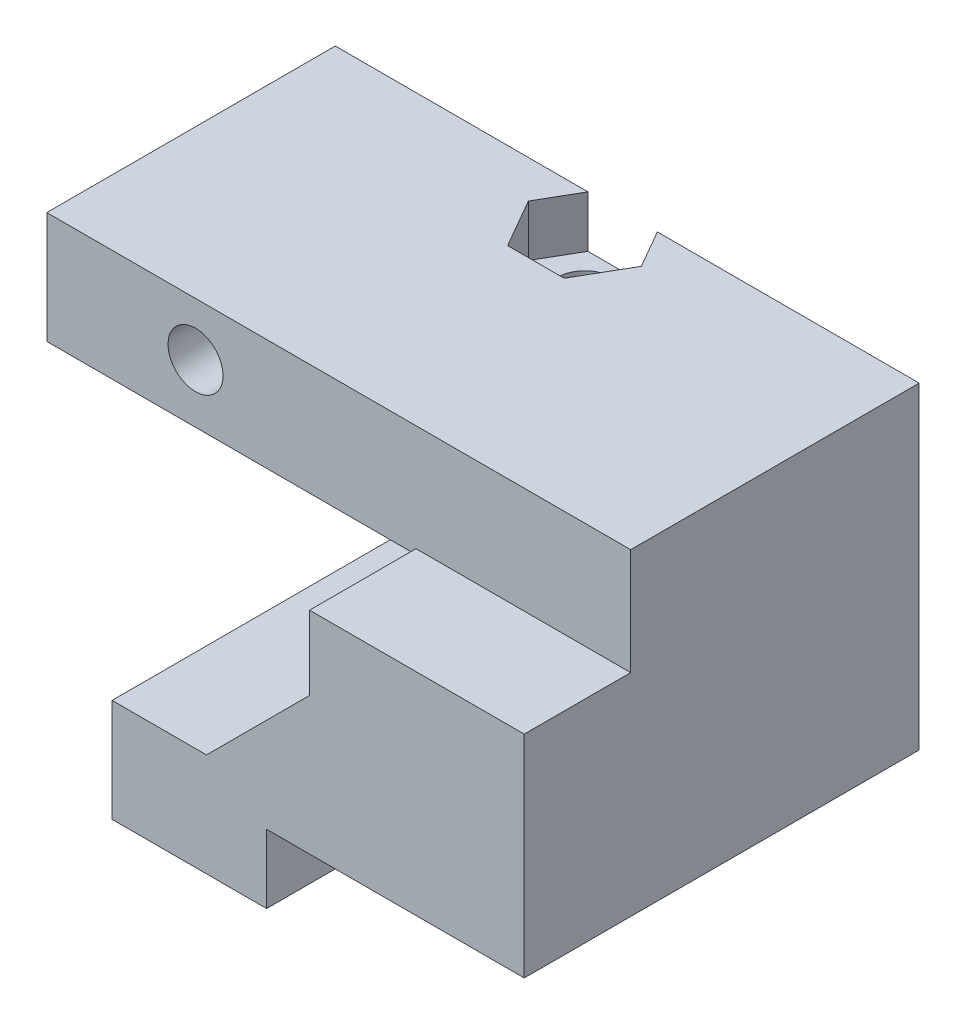
ISO-10303-21;
HEADER;
FILE_DESCRIPTION(('STEP AP214'),'2;1');
FILE_NAME('part.step','',(''),(''),'','','');
FILE_SCHEMA(('AUTOMOTIVE_DESIGN { 1 0 10303 214 1 1 1 1 }'));
ENDSEC;
DATA;
#1=APPLICATION_CONTEXT('core data for automotive mechanical design processes');
#2=APPLICATION_PROTOCOL_DEFINITION('international standard','automotive_design',2000,#1);
#3=PRODUCT_CONTEXT('',#1,'mechanical');
#4=PRODUCT('Part','Part','',(#3));
#5=PRODUCT_RELATED_PRODUCT_CATEGORY('part','',(#4));
#6=PRODUCT_DEFINITION_FORMATION('','',#4);
#7=PRODUCT_DEFINITION_CONTEXT('part definition',#1,'design');
#8=PRODUCT_DEFINITION('design','',#6,#7);
#9=PRODUCT_DEFINITION_SHAPE('','',#8);
#10=(LENGTH_UNIT() NAMED_UNIT(*) SI_UNIT(.MILLI.,.METRE.));
#11=(NAMED_UNIT(*) PLANE_ANGLE_UNIT() SI_UNIT($,.RADIAN.));
#12=(NAMED_UNIT(*) SI_UNIT($,.STERADIAN.) SOLID_ANGLE_UNIT());
#13=UNCERTAINTY_MEASURE_WITH_UNIT(LENGTH_MEASURE(1.E-05),#10,'distance_accuracy_value','');
#14=(GEOMETRIC_REPRESENTATION_CONTEXT(3) GLOBAL_UNCERTAINTY_ASSIGNED_CONTEXT((#13)) GLOBAL_UNIT_ASSIGNED_CONTEXT((#10,
#11,#12)) REPRESENTATION_CONTEXT('',''));
#15=CARTESIAN_POINT('',(0.,0.,0.));
#16=DIRECTION('',(0.,0.,1.));
#17=DIRECTION('',(1.,0.,0.));
#18=AXIS2_PLACEMENT_3D('',#15,#16,#17);
#19=CARTESIAN_POINT('',(6.73,22.501,2.2));
#20=DIRECTION('',(0.,-1.,0.));
#21=DIRECTION('',(0.,0.,-1.));
#22=AXIS2_PLACEMENT_3D('',#19,#20,#21);
#23=CYLINDRICAL_SURFACE('',#22,1.6);
#24=CARTESIAN_POINT('',(6.73,16.,2.2));
#25=DIRECTION('',(0.,-1.,0.));
#26=DIRECTION('',(0.,0.,-1.));
#27=AXIS2_PLACEMENT_3D('',#24,#25,#26);
#28=CIRCLE('',#27,1.6);
#29=CARTESIAN_POINT('',(6.73,16.,0.599999999999997));
#30=VERTEX_POINT('',#29);
#31=EDGE_CURVE('E499',#30,#30,#28,.T.);
#32=ORIENTED_EDGE('',*,*,#31,.T.);
#33=EDGE_LOOP('',(#32));
#34=FACE_BOUND('',#33,.T.);
#35=CARTESIAN_POINT('',(6.73,19.5,2.2));
#36=DIRECTION('',(0.,1.,0.));
#37=DIRECTION('',(0.,0.,1.));
#38=AXIS2_PLACEMENT_3D('',#35,#36,#37);
#39=CIRCLE('',#38,1.6);
#40=CARTESIAN_POINT('',(6.73,19.5,3.8));
#41=VERTEX_POINT('',#40);
#42=EDGE_CURVE('E287',#41,#41,#39,.F.);
#43=ORIENTED_EDGE('',*,*,#42,.F.);
#44=EDGE_LOOP('',(#43));
#45=FACE_BOUND('',#44,.T.);
#46=ADVANCED_FACE('F35',(#34,#45),#23,.F.);
#47=CARTESIAN_POINT('',(11.5,6.,23.));
#48=DIRECTION('',(0.,-1.,0.));
#49=DIRECTION('',(1.,0.,0.));
#50=AXIS2_PLACEMENT_3D('',#47,#48,#49);
#51=PLANE('',#50);
#52=DIRECTION('',(-1.,0.,0.));
#53=VECTOR('',#52,1.);
#54=CARTESIAN_POINT('',(6.59544826719043,6.,0.449999999999999));
#55=LINE('',#54,#53);
#56=CARTESIAN_POINT('',(5.5,6.,0.45));
#57=VERTEX_POINT('',#56);
#58=CARTESIAN_POINT('',(3.30455173280957,6.,0.45));
#59=VERTEX_POINT('',#58);
#60=EDGE_CURVE('E297',#57,#59,#55,.T.);
#61=ORIENTED_EDGE('',*,*,#60,.F.);
#62=DIRECTION('',(0.,0.,-1.));
#63=VECTOR('',#62,1.);
#64=CARTESIAN_POINT('',(5.5,6.,31.4852813742386));
#65=LINE('',#64,#63);
#66=CARTESIAN_POINT('',(5.5,6.,0.));
#67=VERTEX_POINT('',#66);
#68=EDGE_CURVE('E352',#57,#67,#65,.T.);
#69=ORIENTED_EDGE('',*,*,#68,.T.);
#70=DIRECTION('',(-1.,0.,0.));
#71=VECTOR('',#70,1.);
#72=CARTESIAN_POINT('',(11.5,6.,0.));
#73=LINE('',#72,#71);
#74=CARTESIAN_POINT('',(0.,6.,0.));
#75=VERTEX_POINT('',#74);
#76=EDGE_CURVE('E398',#67,#75,#73,.T.);
#77=ORIENTED_EDGE('',*,*,#76,.T.);
#78=DIRECTION('',(0.,0.,-1.));
#79=VECTOR('',#78,1.);
#80=CARTESIAN_POINT('',(0.,6.,23.));
#81=LINE('',#80,#79);
#82=CARTESIAN_POINT('',(0.,6.,23.));
#83=VERTEX_POINT('',#82);
#84=EDGE_CURVE('E394',#83,#75,#81,.T.);
#85=ORIENTED_EDGE('',*,*,#84,.F.);
#86=DIRECTION('',(-1.,0.,0.));
#87=VECTOR('',#86,1.);
#88=CARTESIAN_POINT('',(11.5,6.,23.));
#89=LINE('',#88,#87);
#90=CARTESIAN_POINT('',(5.5,6.,23.));
#91=VERTEX_POINT('',#90);
#92=EDGE_CURVE('E397',#91,#83,#89,.T.);
#93=ORIENTED_EDGE('',*,*,#92,.F.);
#94=CARTESIAN_POINT('',(5.5,6.,6.15));
#95=VERTEX_POINT('',#94);
#96=EDGE_CURVE('E356',#91,#95,#65,.T.);
#97=ORIENTED_EDGE('',*,*,#96,.T.);
#98=DIRECTION('',(1.,0.,0.));
#99=VECTOR('',#98,1.);
#100=CARTESIAN_POINT('',(3.30455173280957,6.,6.15));
#101=LINE('',#100,#99);
#102=CARTESIAN_POINT('',(3.30455173280957,6.,6.15));
#103=VERTEX_POINT('',#102);
#104=EDGE_CURVE('E58',#103,#95,#101,.T.);
#105=ORIENTED_EDGE('',*,*,#104,.F.);
#106=DIRECTION('',(0.5,0.,0.866025403784438));
#107=VECTOR('',#106,1.);
#108=CARTESIAN_POINT('',(1.65910346561913,6.,3.3));
#109=LINE('',#108,#107);
#110=CARTESIAN_POINT('',(1.65910346561913,6.,3.3));
#111=VERTEX_POINT('',#110);
#112=EDGE_CURVE('E315',#111,#103,#109,.T.);
#113=ORIENTED_EDGE('',*,*,#112,.F.);
#114=DIRECTION('',(-0.5,0.,0.866025403784439));
#115=VECTOR('',#114,1.);
#116=CARTESIAN_POINT('',(3.30455173280957,6.,0.45));
#117=LINE('',#116,#115);
#118=EDGE_CURVE('E292',#59,#111,#117,.T.);
#119=ORIENTED_EDGE('',*,*,#118,.F.);
#120=EDGE_LOOP('',(#61,#69,#77,#85,#93,#97,#105,#113,#119));
#121=FACE_BOUND('',#120,.T.);
#122=ADVANCED_FACE('F560',(#121),#51,.F.);
#123=CARTESIAN_POINT('',(4.95,22.501,3.3));
#124=DIRECTION('',(0.,-1.,0.));
#125=DIRECTION('',(0.,0.,-1.));
#126=AXIS2_PLACEMENT_3D('',#123,#124,#125);
#127=CYLINDRICAL_SURFACE('',#126,1.6);
#128=CARTESIAN_POINT('',(4.95,0.,3.3));
#129=DIRECTION('',(0.,-1.,0.));
#130=DIRECTION('',(0.,0.,-1.));
#131=AXIS2_PLACEMENT_3D('',#128,#129,#130);
#132=CIRCLE('',#131,1.6);
#133=CARTESIAN_POINT('',(4.95,0.,1.7));
#134=VERTEX_POINT('',#133);
#135=EDGE_CURVE('E358',#134,#134,#132,.T.);
#136=ORIENTED_EDGE('',*,*,#135,.T.);
#137=EDGE_LOOP('',(#136));
#138=FACE_BOUND('',#137,.T.);
#139=CARTESIAN_POINT('',(4.95,2.,3.3));
#140=DIRECTION('',(0.,1.,0.));
#141=DIRECTION('',(-1.,0.,0.));
#142=AXIS2_PLACEMENT_3D('',#139,#140,#141);
#143=CIRCLE('',#142,1.6);
#144=CARTESIAN_POINT('',(3.35,2.,3.3));
#145=VERTEX_POINT('',#144);
#146=EDGE_CURVE('E341',#145,#145,#143,.F.);
#147=ORIENTED_EDGE('',*,*,#146,.F.);
#148=EDGE_LOOP('',(#147));
#149=FACE_BOUND('',#148,.T.);
#150=ADVANCED_FACE('F517',(#138,#149),#127,.F.);
#151=CARTESIAN_POINT('',(5.5,6.,31.4852813742386));
#152=DIRECTION('',(-0.707106781186551,0.707106781186544,0.));
#153=DIRECTION('',(-0.707106781186544,-0.707106781186551,0.));
#154=AXIS2_PLACEMENT_3D('',#151,#152,#153);
#155=PLANE('',#154);
#156=ORIENTED_EDGE('',*,*,#68,.F.);
#157=DIRECTION('',(-0.707106781186544,-0.707106781186551,0.));
#158=VECTOR('',#157,1.);
#159=CARTESIAN_POINT('',(14.2982241335952,14.7982241335953,0.449999999999997));
#160=LINE('',#159,#158);
#161=CARTESIAN_POINT('',(6.59544826719044,7.09544826719045,0.449999999999999));
#162=VERTEX_POINT('',#161);
#163=EDGE_CURVE('E331',#162,#57,#160,.T.);
#164=ORIENTED_EDGE('',*,*,#163,.F.);
#165=DIRECTION('',(-0.447213595499957,-0.447213595499961,-0.774596669241482));
#166=VECTOR('',#165,1.);
#167=CARTESIAN_POINT('',(10.9929172275047,11.4929172275048,8.0666396639714));
#168=LINE('',#167,#166);
#169=CARTESIAN_POINT('',(8.24089653438087,8.7408965343809,3.3));
#170=VERTEX_POINT('',#169);
#171=EDGE_CURVE('E327',#170,#162,#168,.T.);
#172=ORIENTED_EDGE('',*,*,#171,.F.);
#173=DIRECTION('',(0.447213595499957,0.447213595499961,-0.774596669241482));
#174=VECTOR('',#173,1.);
#175=CARTESIAN_POINT('',(9.67655861375236,10.1765586137524,0.813360336028591));
#176=LINE('',#175,#174);
#177=CARTESIAN_POINT('',(6.59544826719044,7.09544826719045,6.15));
#178=VERTEX_POINT('',#177);
#179=EDGE_CURVE('E330',#178,#170,#176,.T.);
#180=ORIENTED_EDGE('',*,*,#179,.F.);
#181=DIRECTION('',(0.707106781186544,0.707106781186551,0.));
#182=VECTOR('',#181,1.);
#183=CARTESIAN_POINT('',(12.6527758664048,13.1527758664049,6.15));
#184=LINE('',#183,#182);
#185=EDGE_CURVE('E334',#95,#178,#184,.T.);
#186=ORIENTED_EDGE('',*,*,#185,.F.);
#187=ORIENTED_EDGE('',*,*,#96,.F.);
#188=DIRECTION('',(0.707106781186544,0.707106781186551,0.));
#189=VECTOR('',#188,1.);
#190=CARTESIAN_POINT('',(5.5,6.,23.));
#191=LINE('',#190,#189);
#192=CARTESIAN_POINT('',(11.5,12.0000000000001,23.));
#193=VERTEX_POINT('',#192);
#194=EDGE_CURVE('E353',#91,#193,#191,.T.);
#195=ORIENTED_EDGE('',*,*,#194,.T.);
#196=DIRECTION('',(0.,0.,-1.));
#197=VECTOR('',#196,1.);
#198=CARTESIAN_POINT('',(11.5,12.0000000000001,31.4852813742386));
#199=LINE('',#198,#197);
#200=CARTESIAN_POINT('',(11.5,12.0000000000001,0.));
#201=VERTEX_POINT('',#200);
#202=EDGE_CURVE('E355',#193,#201,#199,.T.);
#203=ORIENTED_EDGE('',*,*,#202,.T.);
#204=DIRECTION('',(0.707106781186544,0.707106781186551,0.));
#205=VECTOR('',#204,1.);
#206=CARTESIAN_POINT('',(5.5,6.,0.));
#207=LINE('',#206,#205);
#208=EDGE_CURVE('E349',#67,#201,#207,.T.);
#209=ORIENTED_EDGE('',*,*,#208,.F.);
#210=EDGE_LOOP('',(#156,#164,#172,#180,#186,#187,#195,#203,#209));
#211=FACE_BOUND('',#210,.T.);
#212=ADVANCED_FACE('F565',(#211),#155,.T.);
#213=CARTESIAN_POINT('',(-10.,22.5,23.));
#214=DIRECTION('',(1.,0.,0.));
#215=DIRECTION('',(0.,0.,-1.));
#216=AXIS2_PLACEMENT_3D('',#213,#214,#215);
#217=PLANE('',#216);
#218=DIRECTION('',(0.,0.,-1.));
#219=VECTOR('',#218,1.);
#220=CARTESIAN_POINT('',(-10.,16.,23.));
#221=LINE('',#220,#219);
#222=CARTESIAN_POINT('',(-10.,16.,16.8));
#223=VERTEX_POINT('',#222);
#224=CARTESIAN_POINT('',(-10.,16.,0.));
#225=VERTEX_POINT('',#224);
#226=EDGE_CURVE('E390',#223,#225,#221,.T.);
#227=ORIENTED_EDGE('',*,*,#226,.F.);
#228=DIRECTION('',(0.,-1.,0.));
#229=VECTOR('',#228,1.);
#230=CARTESIAN_POINT('',(-10.,22.5,16.8));
#231=LINE('',#230,#229);
#232=CARTESIAN_POINT('',(-10.,22.5,16.8));
#233=VERTEX_POINT('',#232);
#234=EDGE_CURVE('E447',#233,#223,#231,.T.);
#235=ORIENTED_EDGE('',*,*,#234,.F.);
#236=DIRECTION('',(0.,0.,-1.));
#237=VECTOR('',#236,1.);
#238=CARTESIAN_POINT('',(-10.,22.5,23.));
#239=LINE('',#238,#237);
#240=CARTESIAN_POINT('',(-10.,22.5,0.));
#241=VERTEX_POINT('',#240);
#242=EDGE_CURVE('E387',#233,#241,#239,.T.);
#243=ORIENTED_EDGE('',*,*,#242,.T.);
#244=DIRECTION('',(0.,-1.,0.));
#245=VECTOR('',#244,1.);
#246=CARTESIAN_POINT('',(-10.,22.5,0.));
#247=LINE('',#246,#245);
#248=EDGE_CURVE('E407',#241,#225,#247,.T.);
#249=ORIENTED_EDGE('',*,*,#248,.T.);
#250=EDGE_LOOP('',(#227,#235,#243,#249));
#251=FACE_BOUND('',#250,.T.);
#252=ADVANCED_FACE('F663',(#251),#217,.F.);
#253=CARTESIAN_POINT('',(-10.,16.,23.));
#254=DIRECTION('',(0.,1.,0.));
#255=DIRECTION('',(-1.,0.,0.));
#256=AXIS2_PLACEMENT_3D('',#253,#254,#255);
#257=PLANE('',#256);
#258=ORIENTED_EDGE('',*,*,#31,.F.);
#259=EDGE_LOOP('',(#258));
#260=FACE_BOUND('',#259,.T.);
#261=DIRECTION('',(-1.,0.,0.));
#262=VECTOR('',#261,1.);
#263=CARTESIAN_POINT('',(11.5,16.,16.8));
#264=LINE('',#263,#262);
#265=CARTESIAN_POINT('',(11.5,16.,16.8));
#266=VERTEX_POINT('',#265);
#267=EDGE_CURVE('E458',#266,#223,#264,.T.);
#268=ORIENTED_EDGE('',*,*,#267,.T.);
#269=ORIENTED_EDGE('',*,*,#226,.T.);
#270=DIRECTION('',(1.,0.,0.));
#271=VECTOR('',#270,1.);
#272=CARTESIAN_POINT('',(-10.,16.,0.));
#273=LINE('',#272,#271);
#274=CARTESIAN_POINT('',(11.5,16.,0.));
#275=VERTEX_POINT('',#274);
#276=EDGE_CURVE('E404',#225,#275,#273,.T.);
#277=ORIENTED_EDGE('',*,*,#276,.T.);
#278=DIRECTION('',(0.,0.,-1.));
#279=VECTOR('',#278,1.);
#280=CARTESIAN_POINT('',(11.5,16.,23.));
#281=LINE('',#280,#279);
#282=EDGE_CURVE('E392',#266,#275,#281,.T.);
#283=ORIENTED_EDGE('',*,*,#282,.F.);
#284=EDGE_LOOP('',(#268,#269,#277,#283));
#285=FACE_BOUND('',#284,.T.);
#286=ADVANCED_FACE('F659',(#260,#285),#257,.F.);
#287=CARTESIAN_POINT('',(24.,22.5,23.));
#288=DIRECTION('',(0.,-1.,0.));
#289=DIRECTION('',(1.,0.,0.));
#290=AXIS2_PLACEMENT_3D('',#287,#288,#289);
#291=PLANE('',#290);
#292=DIRECTION('',(0.5,0.,0.866025403784438));
#293=VECTOR('',#292,1.);
#294=CARTESIAN_POINT('',(3.43910346561913,22.5,2.2));
#295=LINE('',#294,#293);
#296=CARTESIAN_POINT('',(3.43910346561913,22.5,2.2));
#297=VERTEX_POINT('',#296);
#298=CARTESIAN_POINT('',(5.08455173280957,22.5,5.05));
#299=VERTEX_POINT('',#298);
#300=EDGE_CURVE('E276',#297,#299,#295,.T.);
#301=ORIENTED_EDGE('',*,*,#300,.F.);
#302=DIRECTION('',(-0.499999999999999,0.,0.866025403784439));
#303=VECTOR('',#302,1.);
#304=CARTESIAN_POINT('',(5.08455173280957,22.5,-0.650000000000003));
#305=LINE('',#304,#303);
#306=CARTESIAN_POINT('',(4.70927405783631,22.5,0.));
#307=VERTEX_POINT('',#306);
#308=EDGE_CURVE('E260',#307,#297,#305,.T.);
#309=ORIENTED_EDGE('',*,*,#308,.F.);
#310=DIRECTION('',(-1.,0.,0.));
#311=VECTOR('',#310,1.);
#312=CARTESIAN_POINT('',(24.,22.5,0.));
#313=LINE('',#312,#311);
#314=EDGE_CURVE('E413',#307,#241,#313,.T.);
#315=ORIENTED_EDGE('',*,*,#314,.T.);
#316=ORIENTED_EDGE('',*,*,#242,.F.);
#317=DIRECTION('',(-1.,0.,0.));
#318=VECTOR('',#317,1.);
#319=CARTESIAN_POINT('',(-10.,22.5,16.8));
#320=LINE('',#319,#318);
#321=CARTESIAN_POINT('',(24.,22.5,16.8));
#322=VERTEX_POINT('',#321);
#323=EDGE_CURVE('E444',#322,#233,#320,.T.);
#324=ORIENTED_EDGE('',*,*,#323,.F.);
#325=DIRECTION('',(0.,0.,-1.));
#326=VECTOR('',#325,1.);
#327=CARTESIAN_POINT('',(24.,22.5,23.));
#328=LINE('',#327,#326);
#329=CARTESIAN_POINT('',(24.,22.5,0.));
#330=VERTEX_POINT('',#329);
#331=EDGE_CURVE('E385',#322,#330,#328,.T.);
#332=ORIENTED_EDGE('',*,*,#331,.T.);
#333=CARTESIAN_POINT('',(8.75072594216369,22.5,0.));
#334=VERTEX_POINT('',#333);
#335=EDGE_CURVE('E410',#330,#334,#313,.T.);
#336=ORIENTED_EDGE('',*,*,#335,.T.);
#337=DIRECTION('',(-0.5,0.,-0.866025403784438));
#338=VECTOR('',#337,1.);
#339=CARTESIAN_POINT('',(10.0208965343809,22.5,2.2));
#340=LINE('',#339,#338);
#341=CARTESIAN_POINT('',(10.0208965343809,22.5,2.2));
#342=VERTEX_POINT('',#341);
#343=EDGE_CURVE('E254',#342,#334,#340,.T.);
#344=ORIENTED_EDGE('',*,*,#343,.F.);
#345=DIRECTION('',(0.5,0.,-0.866025403784439));
#346=VECTOR('',#345,1.);
#347=CARTESIAN_POINT('',(8.37544826719044,22.5,5.05));
#348=LINE('',#347,#346);
#349=CARTESIAN_POINT('',(8.37544826719044,22.5,5.05));
#350=VERTEX_POINT('',#349);
#351=EDGE_CURVE('E281',#350,#342,#348,.T.);
#352=ORIENTED_EDGE('',*,*,#351,.F.);
#353=DIRECTION('',(1.,0.,0.));
#354=VECTOR('',#353,1.);
#355=CARTESIAN_POINT('',(5.08455173280957,22.5,5.05));
#356=LINE('',#355,#354);
#357=EDGE_CURVE('E278',#299,#350,#356,.T.);
#358=ORIENTED_EDGE('',*,*,#357,.F.);
#359=EDGE_LOOP('',(#301,#309,#315,#316,#324,#332,#336,#344,#352,#358));
#360=FACE_BOUND('',#359,.T.);
#361=ADVANCED_FACE('F662',(#360),#291,.F.);
#362=CARTESIAN_POINT('',(0.,6.,23.));
#363=DIRECTION('',(1.,0.,0.));
#364=DIRECTION('',(0.,1.,0.));
#365=AXIS2_PLACEMENT_3D('',#362,#363,#364);
#366=PLANE('',#365);
#367=DIRECTION('',(0.,-1.,0.));
#368=VECTOR('',#367,1.);
#369=CARTESIAN_POINT('',(0.,6.,0.));
#370=LINE('',#369,#368);
#371=CARTESIAN_POINT('',(0.,0.,0.));
#372=VERTEX_POINT('',#371);
#373=EDGE_CURVE('E423',#75,#372,#370,.T.);
#374=ORIENTED_EDGE('',*,*,#373,.T.);
#375=DIRECTION('',(0.,0.,-1.));
#376=VECTOR('',#375,1.);
#377=CARTESIAN_POINT('',(0.,0.,23.));
#378=LINE('',#377,#376);
#379=CARTESIAN_POINT('',(0.,0.,23.));
#380=VERTEX_POINT('',#379);
#381=EDGE_CURVE('E373',#380,#372,#378,.T.);
#382=ORIENTED_EDGE('',*,*,#381,.F.);
#383=DIRECTION('',(0.,-1.,0.));
#384=VECTOR('',#383,1.);
#385=CARTESIAN_POINT('',(0.,6.,23.));
#386=LINE('',#385,#384);
#387=EDGE_CURVE('E400',#83,#380,#386,.T.);
#388=ORIENTED_EDGE('',*,*,#387,.F.);
#389=ORIENTED_EDGE('',*,*,#84,.T.);
#390=EDGE_LOOP('',(#374,#382,#388,#389));
#391=FACE_BOUND('',#390,.T.);
#392=ADVANCED_FACE('F37',(#391),#366,.F.);
#393=CARTESIAN_POINT('',(0.,0.,23.));
#394=DIRECTION('',(0.,1.,0.));
#395=DIRECTION('',(0.,0.,1.));
#396=AXIS2_PLACEMENT_3D('',#393,#394,#395);
#397=PLANE('',#396);
#398=ORIENTED_EDGE('',*,*,#135,.F.);
#399=EDGE_LOOP('',(#398));
#400=FACE_BOUND('',#399,.T.);
#401=DIRECTION('',(1.,0.,0.));
#402=VECTOR('',#401,1.);
#403=CARTESIAN_POINT('',(0.,0.,0.));
#404=LINE('',#403,#402);
#405=CARTESIAN_POINT('',(9.,0.,0.));
#406=VERTEX_POINT('',#405);
#407=EDGE_CURVE('E421',#372,#406,#404,.T.);
#408=ORIENTED_EDGE('',*,*,#407,.T.);
#409=DIRECTION('',(0.,0.,-1.));
#410=VECTOR('',#409,1.);
#411=CARTESIAN_POINT('',(9.,0.,23.));
#412=LINE('',#411,#410);
#413=CARTESIAN_POINT('',(9.,0.,23.));
#414=VERTEX_POINT('',#413);
#415=EDGE_CURVE('E376',#414,#406,#412,.T.);
#416=ORIENTED_EDGE('',*,*,#415,.F.);
#417=DIRECTION('',(1.,0.,0.));
#418=VECTOR('',#417,1.);
#419=CARTESIAN_POINT('',(0.,0.,23.));
#420=LINE('',#419,#418);
#421=EDGE_CURVE('E438',#380,#414,#420,.T.);
#422=ORIENTED_EDGE('',*,*,#421,.F.);
#423=ORIENTED_EDGE('',*,*,#381,.T.);
#424=EDGE_LOOP('',(#408,#416,#422,#423));
#425=FACE_BOUND('',#424,.T.);
#426=ADVANCED_FACE('F520',(#400,#425),#397,.F.);
#427=CARTESIAN_POINT('',(9.,0.,23.));
#428=DIRECTION('',(-1.,0.,0.));
#429=DIRECTION('',(0.,-1.,0.));
#430=AXIS2_PLACEMENT_3D('',#427,#428,#429);
#431=PLANE('',#430);
#432=DIRECTION('',(0.,1.,0.));
#433=VECTOR('',#432,1.);
#434=CARTESIAN_POINT('',(9.,0.,0.));
#435=LINE('',#434,#433);
#436=CARTESIAN_POINT('',(9.,4.,0.));
#437=VERTEX_POINT('',#436);
#438=EDGE_CURVE('E419',#406,#437,#435,.T.);
#439=ORIENTED_EDGE('',*,*,#438,.T.);
#440=DIRECTION('',(0.,0.,-1.));
#441=VECTOR('',#440,1.);
#442=CARTESIAN_POINT('',(9.,4.,23.));
#443=LINE('',#442,#441);
#444=CARTESIAN_POINT('',(9.,4.,23.));
#445=VERTEX_POINT('',#444);
#446=EDGE_CURVE('E379',#445,#437,#443,.T.);
#447=ORIENTED_EDGE('',*,*,#446,.F.);
#448=DIRECTION('',(0.,1.,0.));
#449=VECTOR('',#448,1.);
#450=CARTESIAN_POINT('',(9.,0.,23.));
#451=LINE('',#450,#449);
#452=EDGE_CURVE('E436',#414,#445,#451,.T.);
#453=ORIENTED_EDGE('',*,*,#452,.F.);
#454=ORIENTED_EDGE('',*,*,#415,.T.);
#455=EDGE_LOOP('',(#439,#447,#453,#454));
#456=FACE_BOUND('',#455,.T.);
#457=ADVANCED_FACE('F523',(#456),#431,.F.);
#458=CARTESIAN_POINT('',(9.,4.,23.));
#459=DIRECTION('',(0.,1.,0.));
#460=DIRECTION('',(0.,0.,1.));
#461=AXIS2_PLACEMENT_3D('',#458,#459,#460);
#462=PLANE('',#461);
#463=DIRECTION('',(1.,0.,0.));
#464=VECTOR('',#463,1.);
#465=CARTESIAN_POINT('',(9.,4.,0.));
#466=LINE('',#465,#464);
#467=CARTESIAN_POINT('',(24.,4.,0.));
#468=VERTEX_POINT('',#467);
#469=EDGE_CURVE('E417',#437,#468,#466,.T.);
#470=ORIENTED_EDGE('',*,*,#469,.T.);
#471=DIRECTION('',(0.,0.,-1.));
#472=VECTOR('',#471,1.);
#473=CARTESIAN_POINT('',(24.,4.,23.));
#474=LINE('',#473,#472);
#475=CARTESIAN_POINT('',(24.,4.,23.));
#476=VERTEX_POINT('',#475);
#477=EDGE_CURVE('E382',#476,#468,#474,.T.);
#478=ORIENTED_EDGE('',*,*,#477,.F.);
#479=DIRECTION('',(1.,0.,0.));
#480=VECTOR('',#479,1.);
#481=CARTESIAN_POINT('',(9.,4.,23.));
#482=LINE('',#481,#480);
#483=EDGE_CURVE('E434',#445,#476,#482,.T.);
#484=ORIENTED_EDGE('',*,*,#483,.F.);
#485=ORIENTED_EDGE('',*,*,#446,.T.);
#486=EDGE_LOOP('',(#470,#478,#484,#485));
#487=FACE_BOUND('',#486,.T.);
#488=ADVANCED_FACE('F540',(#487),#462,.F.);
#489=CARTESIAN_POINT('',(24.,4.,23.));
#490=DIRECTION('',(-1.,0.,0.));
#491=DIRECTION('',(0.,0.,1.));
#492=AXIS2_PLACEMENT_3D('',#489,#490,#491);
#493=PLANE('',#492);
#494=DIRECTION('',(0.,1.,0.));
#495=VECTOR('',#494,1.);
#496=CARTESIAN_POINT('',(24.,22.5,16.8));
#497=LINE('',#496,#495);
#498=CARTESIAN_POINT('',(24.,16.3,16.8));
#499=VERTEX_POINT('',#498);
#500=EDGE_CURVE('E450',#499,#322,#497,.T.);
#501=ORIENTED_EDGE('',*,*,#500,.F.);
#502=DIRECTION('',(0.,0.,1.));
#503=VECTOR('',#502,1.);
#504=CARTESIAN_POINT('',(24.,16.3,16.8));
#505=LINE('',#504,#503);
#506=CARTESIAN_POINT('',(24.,16.3,23.));
#507=VERTEX_POINT('',#506);
#508=EDGE_CURVE('E426',#499,#507,#505,.T.);
#509=ORIENTED_EDGE('',*,*,#508,.T.);
#510=DIRECTION('',(0.,1.,0.));
#511=VECTOR('',#510,1.);
#512=CARTESIAN_POINT('',(24.,4.,23.));
#513=LINE('',#512,#511);
#514=EDGE_CURVE('E431',#476,#507,#513,.T.);
#515=ORIENTED_EDGE('',*,*,#514,.F.);
#516=ORIENTED_EDGE('',*,*,#477,.T.);
#517=DIRECTION('',(0.,1.,0.));
#518=VECTOR('',#517,1.);
#519=CARTESIAN_POINT('',(24.,4.,0.));
#520=LINE('',#519,#518);
#521=EDGE_CURVE('E414',#468,#330,#520,.T.);
#522=ORIENTED_EDGE('',*,*,#521,.T.);
#523=ORIENTED_EDGE('',*,*,#331,.F.);
#524=EDGE_LOOP('',(#501,#509,#515,#516,#522,#523));
#525=FACE_BOUND('',#524,.T.);
#526=ADVANCED_FACE('F545',(#525),#493,.F.);
#527=CARTESIAN_POINT('',(11.5,16.,23.));
#528=DIRECTION('',(1.,0.,0.));
#529=DIRECTION('',(0.,0.,-1.));
#530=AXIS2_PLACEMENT_3D('',#527,#528,#529);
#531=PLANE('',#530);
#532=DIRECTION('',(0.,-1.,0.));
#533=VECTOR('',#532,1.);
#534=CARTESIAN_POINT('',(11.5,16.,0.));
#535=LINE('',#534,#533);
#536=EDGE_CURVE('E401',#275,#201,#535,.T.);
#537=ORIENTED_EDGE('',*,*,#536,.T.);
#538=ORIENTED_EDGE('',*,*,#202,.F.);
#539=DIRECTION('',(0.,-1.,0.));
#540=VECTOR('',#539,1.);
#541=CARTESIAN_POINT('',(11.5,16.,23.));
#542=LINE('',#541,#540);
#543=CARTESIAN_POINT('',(11.5,16.3,23.));
#544=VERTEX_POINT('',#543);
#545=EDGE_CURVE('E428',#544,#193,#542,.T.);
#546=ORIENTED_EDGE('',*,*,#545,.F.);
#547=DIRECTION('',(0.,0.,1.));
#548=VECTOR('',#547,1.);
#549=CARTESIAN_POINT('',(11.5,16.3,-4.70209292138791));
#550=LINE('',#549,#548);
#551=CARTESIAN_POINT('',(11.5,16.3,16.8));
#552=VERTEX_POINT('',#551);
#553=EDGE_CURVE('E455',#552,#544,#550,.T.);
#554=ORIENTED_EDGE('',*,*,#553,.F.);
#555=DIRECTION('',(0.,-1.,0.));
#556=VECTOR('',#555,1.);
#557=CARTESIAN_POINT('',(11.5,16.,16.8));
#558=LINE('',#557,#556);
#559=EDGE_CURVE('E448',#552,#266,#558,.T.);
#560=ORIENTED_EDGE('',*,*,#559,.T.);
#561=ORIENTED_EDGE('',*,*,#282,.T.);
#562=EDGE_LOOP('',(#537,#538,#546,#554,#560,#561));
#563=FACE_BOUND('',#562,.T.);
#564=ADVANCED_FACE('F569',(#563),#531,.F.);
#565=CARTESIAN_POINT('',(0.,0.,23.));
#566=DIRECTION('',(0.,0.,1.));
#567=DIRECTION('',(1.,0.,0.));
#568=AXIS2_PLACEMENT_3D('',#565,#566,#567);
#569=PLANE('',#568);
#570=ORIENTED_EDGE('',*,*,#194,.F.);
#571=ORIENTED_EDGE('',*,*,#92,.T.);
#572=ORIENTED_EDGE('',*,*,#387,.T.);
#573=ORIENTED_EDGE('',*,*,#421,.T.);
#574=ORIENTED_EDGE('',*,*,#452,.T.);
#575=ORIENTED_EDGE('',*,*,#483,.T.);
#576=ORIENTED_EDGE('',*,*,#514,.T.);
#577=DIRECTION('',(1.,0.,0.));
#578=VECTOR('',#577,1.);
#579=CARTESIAN_POINT('',(-10.,16.3,23.));
#580=LINE('',#579,#578);
#581=EDGE_CURVE('E445',#544,#507,#580,.T.);
#582=ORIENTED_EDGE('',*,*,#581,.F.);
#583=ORIENTED_EDGE('',*,*,#545,.T.);
#584=EDGE_LOOP('',(#570,#571,#572,#573,#574,#575,#576,#582,#583));
#585=FACE_BOUND('',#584,.T.);
#586=ADVANCED_FACE('F550',(#585),#569,.T.);
#587=CARTESIAN_POINT('',(0.,0.,0.));
#588=DIRECTION('',(0.,0.,1.));
#589=DIRECTION('',(1.,0.,0.));
#590=AXIS2_PLACEMENT_3D('',#587,#588,#589);
#591=PLANE('',#590);
#592=ORIENTED_EDGE('',*,*,#314,.F.);
#593=DIRECTION('',(0.,-1.,0.));
#594=VECTOR('',#593,1.);
#595=CARTESIAN_POINT('',(4.70927405783631,0.,0.));
#596=LINE('',#595,#594);
#597=CARTESIAN_POINT('',(4.70927405783631,19.5,0.));
#598=VERTEX_POINT('',#597);
#599=EDGE_CURVE('E12',#307,#598,#596,.T.);
#600=ORIENTED_EDGE('',*,*,#599,.T.);
#601=DIRECTION('',(-1.,0.,0.));
#602=VECTOR('',#601,1.);
#603=CARTESIAN_POINT('',(0.,19.5,0.));
#604=LINE('',#603,#602);
#605=CARTESIAN_POINT('',(8.75072594216369,19.5,0.));
#606=VERTEX_POINT('',#605);
#607=EDGE_CURVE('E252',#606,#598,#604,.T.);
#608=ORIENTED_EDGE('',*,*,#607,.F.);
#609=DIRECTION('',(0.,1.,0.));
#610=VECTOR('',#609,1.);
#611=CARTESIAN_POINT('',(8.75072594216369,0.,0.));
#612=LINE('',#611,#610);
#613=EDGE_CURVE('E43',#606,#334,#612,.T.);
#614=ORIENTED_EDGE('',*,*,#613,.T.);
#615=ORIENTED_EDGE('',*,*,#335,.F.);
#616=ORIENTED_EDGE('',*,*,#521,.F.);
#617=ORIENTED_EDGE('',*,*,#469,.F.);
#618=ORIENTED_EDGE('',*,*,#438,.F.);
#619=ORIENTED_EDGE('',*,*,#407,.F.);
#620=ORIENTED_EDGE('',*,*,#373,.F.);
#621=ORIENTED_EDGE('',*,*,#76,.F.);
#622=ORIENTED_EDGE('',*,*,#208,.T.);
#623=ORIENTED_EDGE('',*,*,#536,.F.);
#624=ORIENTED_EDGE('',*,*,#276,.F.);
#625=ORIENTED_EDGE('',*,*,#248,.F.);
#626=EDGE_LOOP('',(#592,#600,#608,#614,#615,#616,#617,#618,#619,#620,#621,#622,#623,#624,#625));
#627=FACE_BOUND('',#626,.T.);
#628=DIRECTION('',(-1.,0.,0.));
#629=VECTOR('',#628,1.);
#630=CARTESIAN_POINT('',(0.305448267190431,16.55,0.));
#631=LINE('',#630,#629);
#632=CARTESIAN_POINT('',(0.305448267190431,16.55,0.));
#633=VERTEX_POINT('',#632);
#634=CARTESIAN_POINT('',(-2.98544826719043,16.55,0.));
#635=VERTEX_POINT('',#634);
#636=EDGE_CURVE('E502',#633,#635,#631,.T.);
#637=ORIENTED_EDGE('',*,*,#636,.F.);
#638=DIRECTION('',(-0.5,-0.866025403784439,0.));
#639=VECTOR('',#638,1.);
#640=CARTESIAN_POINT('',(1.95089653438086,19.4,0.));
#641=LINE('',#640,#639);
#642=CARTESIAN_POINT('',(1.95089653438086,19.4,0.));
#643=VERTEX_POINT('',#642);
#644=EDGE_CURVE('E498',#643,#633,#641,.T.);
#645=ORIENTED_EDGE('',*,*,#644,.F.);
#646=DIRECTION('',(0.5,-0.866025403784439,0.));
#647=VECTOR('',#646,1.);
#648=CARTESIAN_POINT('',(0.305448267190435,22.25,0.));
#649=LINE('',#648,#647);
#650=CARTESIAN_POINT('',(0.305448267190433,22.25,0.));
#651=VERTEX_POINT('',#650);
#652=EDGE_CURVE('E495',#651,#643,#649,.T.);
#653=ORIENTED_EDGE('',*,*,#652,.F.);
#654=DIRECTION('',(1.,0.,0.));
#655=VECTOR('',#654,1.);
#656=CARTESIAN_POINT('',(-2.98544826719043,22.25,0.));
#657=LINE('',#656,#655);
#658=CARTESIAN_POINT('',(-2.98544826719043,22.25,0.));
#659=VERTEX_POINT('',#658);
#660=EDGE_CURVE('E494',#659,#651,#657,.T.);
#661=ORIENTED_EDGE('',*,*,#660,.F.);
#662=DIRECTION('',(0.5,0.866025403784439,0.));
#663=VECTOR('',#662,1.);
#664=CARTESIAN_POINT('',(-4.63089653438086,19.4,0.));
#665=LINE('',#664,#663);
#666=CARTESIAN_POINT('',(-4.63089653438086,19.4,0.));
#667=VERTEX_POINT('',#666);
#668=EDGE_CURVE('E508',#667,#659,#665,.T.);
#669=ORIENTED_EDGE('',*,*,#668,.F.);
#670=DIRECTION('',(-0.5,0.866025403784439,0.));
#671=VECTOR('',#670,1.);
#672=CARTESIAN_POINT('',(-2.98544826719043,16.55,0.));
#673=LINE('',#672,#671);
#674=EDGE_CURVE('E505',#635,#667,#673,.T.);
#675=ORIENTED_EDGE('',*,*,#674,.F.);
#676=EDGE_LOOP('',(#637,#645,#653,#661,#669,#675));
#677=FACE_BOUND('',#676,.T.);
#678=ADVANCED_FACE('F534',(#627,#677),#591,.F.);
#679=CARTESIAN_POINT('',(-10.,16.3,16.8));
#680=DIRECTION('',(0.,-1.,0.));
#681=DIRECTION('',(1.,0.,0.));
#682=AXIS2_PLACEMENT_3D('',#679,#680,#681);
#683=PLANE('',#682);
#684=DIRECTION('',(1.,0.,0.));
#685=VECTOR('',#684,1.);
#686=CARTESIAN_POINT('',(-10.,16.3,16.8));
#687=LINE('',#686,#685);
#688=EDGE_CURVE('E452',#552,#499,#687,.T.);
#689=ORIENTED_EDGE('',*,*,#688,.F.);
#690=ORIENTED_EDGE('',*,*,#553,.T.);
#691=ORIENTED_EDGE('',*,*,#581,.T.);
#692=ORIENTED_EDGE('',*,*,#508,.F.);
#693=EDGE_LOOP('',(#689,#690,#691,#692));
#694=FACE_BOUND('',#693,.T.);
#695=ADVANCED_FACE('F648',(#694),#683,.F.);
#696=CARTESIAN_POINT('',(-10.,16.3,16.8));
#697=DIRECTION('',(0.,0.,1.));
#698=DIRECTION('',(1.,0.,0.));
#699=AXIS2_PLACEMENT_3D('',#696,#697,#698);
#700=PLANE('',#699);
#701=CARTESIAN_POINT('',(-1.34,19.4,16.8));
#702=DIRECTION('',(0.,0.,1.));
#703=DIRECTION('',(1.,0.,0.));
#704=AXIS2_PLACEMENT_3D('',#701,#702,#703);
#705=CIRCLE('',#704,1.6);
#706=CARTESIAN_POINT('',(0.259999999999999,19.4,16.8));
#707=VERTEX_POINT('',#706);
#708=EDGE_CURVE('E371',#707,#707,#705,.T.);
#709=ORIENTED_EDGE('',*,*,#708,.F.);
#710=EDGE_LOOP('',(#709));
#711=FACE_BOUND('',#710,.T.);
#712=ORIENTED_EDGE('',*,*,#234,.T.);
#713=ORIENTED_EDGE('',*,*,#267,.F.);
#714=ORIENTED_EDGE('',*,*,#559,.F.);
#715=ORIENTED_EDGE('',*,*,#688,.T.);
#716=ORIENTED_EDGE('',*,*,#500,.T.);
#717=ORIENTED_EDGE('',*,*,#323,.T.);
#718=EDGE_LOOP('',(#712,#713,#714,#715,#716,#717));
#719=FACE_BOUND('',#718,.T.);
#720=ADVANCED_FACE('F644',(#711,#719),#700,.T.);
#721=CARTESIAN_POINT('',(-1.34,19.4,-0.001000000000001));
#722=DIRECTION('',(0.,0.,1.));
#723=DIRECTION('',(1.,0.,0.));
#724=AXIS2_PLACEMENT_3D('',#721,#722,#723);
#725=CYLINDRICAL_SURFACE('',#724,1.6);
#726=CARTESIAN_POINT('',(-1.34,19.4,9.8));
#727=DIRECTION('',(0.,0.,1.));
#728=DIRECTION('',(1.,0.,0.));
#729=AXIS2_PLACEMENT_3D('',#726,#727,#728);
#730=CIRCLE('',#729,1.6);
#731=CARTESIAN_POINT('',(0.259999999999999,19.4,9.8));
#732=VERTEX_POINT('',#731);
#733=EDGE_CURVE('E368',#732,#732,#730,.F.);
#734=ORIENTED_EDGE('',*,*,#733,.T.);
#735=EDGE_LOOP('',(#734));
#736=FACE_BOUND('',#735,.T.);
#737=ORIENTED_EDGE('',*,*,#708,.T.);
#738=EDGE_LOOP('',(#737));
#739=FACE_BOUND('',#738,.T.);
#740=ADVANCED_FACE('F640',(#736,#739),#725,.F.);
#741=CARTESIAN_POINT('',(-10.,16.3,9.8));
#742=DIRECTION('',(0.,0.,1.));
#743=DIRECTION('',(1.,0.,0.));
#744=AXIS2_PLACEMENT_3D('',#741,#742,#743);
#745=PLANE('',#744);
#746=DIRECTION('',(0.5,-0.866025403784439,0.));
#747=VECTOR('',#746,1.);
#748=CARTESIAN_POINT('',(0.305448267190435,22.25,9.8));
#749=LINE('',#748,#747);
#750=CARTESIAN_POINT('',(0.305448267190435,22.25,9.8));
#751=VERTEX_POINT('',#750);
#752=CARTESIAN_POINT('',(1.95089653438086,19.4,9.8));
#753=VERTEX_POINT('',#752);
#754=EDGE_CURVE('E465',#751,#753,#749,.T.);
#755=ORIENTED_EDGE('',*,*,#754,.T.);
#756=DIRECTION('',(-0.5,-0.866025403784438,0.));
#757=VECTOR('',#756,1.);
#758=CARTESIAN_POINT('',(1.95089653438086,19.4,9.8));
#759=LINE('',#758,#757);
#760=CARTESIAN_POINT('',(0.305448267190431,16.55,9.8));
#761=VERTEX_POINT('',#760);
#762=EDGE_CURVE('E469',#753,#761,#759,.T.);
#763=ORIENTED_EDGE('',*,*,#762,.T.);
#764=DIRECTION('',(-1.,0.,0.));
#765=VECTOR('',#764,1.);
#766=CARTESIAN_POINT('',(0.305448267190431,16.55,9.8));
#767=LINE('',#766,#765);
#768=CARTESIAN_POINT('',(-2.98544826719043,16.55,9.8));
#769=VERTEX_POINT('',#768);
#770=EDGE_CURVE('E468',#761,#769,#767,.T.);
#771=ORIENTED_EDGE('',*,*,#770,.T.);
#772=DIRECTION('',(-0.5,0.866025403784439,0.));
#773=VECTOR('',#772,1.);
#774=CARTESIAN_POINT('',(-2.98544826719043,16.55,9.8));
#775=LINE('',#774,#773);
#776=CARTESIAN_POINT('',(-4.63089653438086,19.4,9.8));
#777=VERTEX_POINT('',#776);
#778=EDGE_CURVE('E472',#769,#777,#775,.T.);
#779=ORIENTED_EDGE('',*,*,#778,.T.);
#780=DIRECTION('',(0.5,0.866025403784439,0.));
#781=VECTOR('',#780,1.);
#782=CARTESIAN_POINT('',(-4.63089653438086,19.4,9.8));
#783=LINE('',#782,#781);
#784=CARTESIAN_POINT('',(-2.98544826719043,22.25,9.8));
#785=VERTEX_POINT('',#784);
#786=EDGE_CURVE('E475',#777,#785,#783,.T.);
#787=ORIENTED_EDGE('',*,*,#786,.T.);
#788=DIRECTION('',(1.,0.,0.));
#789=VECTOR('',#788,1.);
#790=CARTESIAN_POINT('',(-2.98544826719043,22.25,9.8));
#791=LINE('',#790,#789);
#792=EDGE_CURVE('E478',#785,#751,#791,.T.);
#793=ORIENTED_EDGE('',*,*,#792,.T.);
#794=EDGE_LOOP('',(#755,#763,#771,#779,#787,#793));
#795=FACE_BOUND('',#794,.T.);
#796=ORIENTED_EDGE('',*,*,#733,.F.);
#797=EDGE_LOOP('',(#796));
#798=FACE_BOUND('',#797,.T.);
#799=ADVANCED_FACE('F636',(#795,#798),#745,.F.);
#800=CARTESIAN_POINT('',(1.95089653438086,19.4,25.5068938204161));
#801=DIRECTION('',(0.866025403784439,-0.5,0.));
#802=DIRECTION('',(0.5,0.866025403784438,0.));
#803=AXIS2_PLACEMENT_3D('',#800,#801,#802);
#804=PLANE('',#803);
#805=DIRECTION('',(0.,0.,-1.));
#806=VECTOR('',#805,1.);
#807=CARTESIAN_POINT('',(1.95089653438086,19.4,25.5068938204161));
#808=LINE('',#807,#806);
#809=EDGE_CURVE('E372',#753,#643,#808,.T.);
#810=ORIENTED_EDGE('',*,*,#809,.T.);
#811=ORIENTED_EDGE('',*,*,#644,.T.);
#812=DIRECTION('',(0.,0.,-1.));
#813=VECTOR('',#812,1.);
#814=CARTESIAN_POINT('',(0.305448267190431,16.55,25.5068938204161));
#815=LINE('',#814,#813);
#816=EDGE_CURVE('E466',#761,#633,#815,.T.);
#817=ORIENTED_EDGE('',*,*,#816,.F.);
#818=ORIENTED_EDGE('',*,*,#762,.F.);
#819=EDGE_LOOP('',(#810,#811,#817,#818));
#820=FACE_BOUND('',#819,.T.);
#821=ADVANCED_FACE('F632',(#820),#804,.F.);
#822=CARTESIAN_POINT('',(0.305448267190431,16.55,25.5068938204161));
#823=DIRECTION('',(0.,-1.,0.));
#824=DIRECTION('',(0.,0.,-1.));
#825=AXIS2_PLACEMENT_3D('',#822,#823,#824);
#826=PLANE('',#825);
#827=ORIENTED_EDGE('',*,*,#816,.T.);
#828=ORIENTED_EDGE('',*,*,#636,.T.);
#829=DIRECTION('',(0.,0.,-1.));
#830=VECTOR('',#829,1.);
#831=CARTESIAN_POINT('',(-2.98544826719043,16.55,25.5068938204161));
#832=LINE('',#831,#830);
#833=EDGE_CURVE('E470',#769,#635,#832,.T.);
#834=ORIENTED_EDGE('',*,*,#833,.F.);
#835=ORIENTED_EDGE('',*,*,#770,.F.);
#836=EDGE_LOOP('',(#827,#828,#834,#835));
#837=FACE_BOUND('',#836,.T.);
#838=ADVANCED_FACE('F628',(#837),#826,.F.);
#839=CARTESIAN_POINT('',(-2.98544826719043,16.55,25.5068938204161));
#840=DIRECTION('',(-0.866025403784439,-0.5,0.));
#841=DIRECTION('',(0.5,-0.866025403784439,0.));
#842=AXIS2_PLACEMENT_3D('',#839,#840,#841);
#843=PLANE('',#842);
#844=ORIENTED_EDGE('',*,*,#833,.T.);
#845=ORIENTED_EDGE('',*,*,#674,.T.);
#846=DIRECTION('',(0.,0.,-1.));
#847=VECTOR('',#846,1.);
#848=CARTESIAN_POINT('',(-4.63089653438086,19.4,25.5068938204161));
#849=LINE('',#848,#847);
#850=EDGE_CURVE('E473',#777,#667,#849,.T.);
#851=ORIENTED_EDGE('',*,*,#850,.F.);
#852=ORIENTED_EDGE('',*,*,#778,.F.);
#853=EDGE_LOOP('',(#844,#845,#851,#852));
#854=FACE_BOUND('',#853,.T.);
#855=ADVANCED_FACE('F624',(#854),#843,.F.);
#856=CARTESIAN_POINT('',(-4.63089653438086,19.4,25.5068938204161));
#857=DIRECTION('',(-0.866025403784439,0.5,0.));
#858=DIRECTION('',(-0.5,-0.866025403784439,0.));
#859=AXIS2_PLACEMENT_3D('',#856,#857,#858);
#860=PLANE('',#859);
#861=ORIENTED_EDGE('',*,*,#850,.T.);
#862=ORIENTED_EDGE('',*,*,#668,.T.);
#863=DIRECTION('',(0.,0.,-1.));
#864=VECTOR('',#863,1.);
#865=CARTESIAN_POINT('',(-2.98544826719043,22.25,25.5068938204161));
#866=LINE('',#865,#864);
#867=EDGE_CURVE('E476',#785,#659,#866,.T.);
#868=ORIENTED_EDGE('',*,*,#867,.F.);
#869=ORIENTED_EDGE('',*,*,#786,.F.);
#870=EDGE_LOOP('',(#861,#862,#868,#869));
#871=FACE_BOUND('',#870,.T.);
#872=ADVANCED_FACE('F620',(#871),#860,.F.);
#873=CARTESIAN_POINT('',(-2.98544826719043,22.25,25.5068938204161));
#874=DIRECTION('',(0.,1.,0.));
#875=DIRECTION('',(0.,0.,1.));
#876=AXIS2_PLACEMENT_3D('',#873,#874,#875);
#877=PLANE('',#876);
#878=ORIENTED_EDGE('',*,*,#867,.T.);
#879=ORIENTED_EDGE('',*,*,#660,.T.);
#880=DIRECTION('',(0.,0.,-1.));
#881=VECTOR('',#880,1.);
#882=CARTESIAN_POINT('',(0.305448267190435,22.25,25.5068938204161));
#883=LINE('',#882,#881);
#884=EDGE_CURVE('E479',#751,#651,#883,.T.);
#885=ORIENTED_EDGE('',*,*,#884,.F.);
#886=ORIENTED_EDGE('',*,*,#792,.F.);
#887=EDGE_LOOP('',(#878,#879,#885,#886));
#888=FACE_BOUND('',#887,.T.);
#889=ADVANCED_FACE('F616',(#888),#877,.F.);
#890=CARTESIAN_POINT('',(0.305448267190435,22.25,25.5068938204161));
#891=DIRECTION('',(0.866025403784439,0.5,0.));
#892=DIRECTION('',(-0.5,0.866025403784439,0.));
#893=AXIS2_PLACEMENT_3D('',#890,#891,#892);
#894=PLANE('',#893);
#895=ORIENTED_EDGE('',*,*,#884,.T.);
#896=ORIENTED_EDGE('',*,*,#652,.T.);
#897=ORIENTED_EDGE('',*,*,#809,.F.);
#898=ORIENTED_EDGE('',*,*,#754,.F.);
#899=EDGE_LOOP('',(#895,#896,#897,#898));
#900=FACE_BOUND('',#899,.T.);
#901=ADVANCED_FACE('F613',(#900),#894,.F.);
#902=CARTESIAN_POINT('',(1.65910346561913,2.,3.3));
#903=DIRECTION('',(0.,1.,0.));
#904=DIRECTION('',(-1.,0.,0.));
#905=AXIS2_PLACEMENT_3D('',#902,#903,#904);
#906=PLANE('',#905);
#907=DIRECTION('',(-0.5,0.,0.866025403784439));
#908=VECTOR('',#907,1.);
#909=CARTESIAN_POINT('',(3.30455173280957,2.,0.45));
#910=LINE('',#909,#908);
#911=CARTESIAN_POINT('',(3.30455173280957,2.,0.45));
#912=VERTEX_POINT('',#911);
#913=CARTESIAN_POINT('',(1.65910346561913,2.,3.3));
#914=VERTEX_POINT('',#913);
#915=EDGE_CURVE('E293',#912,#914,#910,.T.);
#916=ORIENTED_EDGE('',*,*,#915,.T.);
#917=DIRECTION('',(0.5,0.,0.866025403784438));
#918=VECTOR('',#917,1.);
#919=CARTESIAN_POINT('',(1.65910346561913,2.,3.3));
#920=LINE('',#919,#918);
#921=CARTESIAN_POINT('',(3.30455173280957,2.,6.15));
#922=VERTEX_POINT('',#921);
#923=EDGE_CURVE('E296',#914,#922,#920,.T.);
#924=ORIENTED_EDGE('',*,*,#923,.T.);
#925=DIRECTION('',(1.,0.,0.));
#926=VECTOR('',#925,1.);
#927=CARTESIAN_POINT('',(3.30455173280957,2.,6.15));
#928=LINE('',#927,#926);
#929=CARTESIAN_POINT('',(6.59544826719044,2.,6.15));
#930=VERTEX_POINT('',#929);
#931=EDGE_CURVE('E300',#922,#930,#928,.T.);
#932=ORIENTED_EDGE('',*,*,#931,.T.);
#933=DIRECTION('',(0.5,0.,-0.866025403784439));
#934=VECTOR('',#933,1.);
#935=CARTESIAN_POINT('',(6.59544826719044,2.,6.15));
#936=LINE('',#935,#934);
#937=CARTESIAN_POINT('',(8.24089653438087,2.,3.3));
#938=VERTEX_POINT('',#937);
#939=EDGE_CURVE('E303',#930,#938,#936,.T.);
#940=ORIENTED_EDGE('',*,*,#939,.T.);
#941=DIRECTION('',(-0.5,0.,-0.866025403784439));
#942=VECTOR('',#941,1.);
#943=CARTESIAN_POINT('',(8.24089653438087,2.,3.3));
#944=LINE('',#943,#942);
#945=CARTESIAN_POINT('',(6.59544826719044,2.,0.449999999999999));
#946=VERTEX_POINT('',#945);
#947=EDGE_CURVE('E306',#938,#946,#944,.T.);
#948=ORIENTED_EDGE('',*,*,#947,.T.);
#949=DIRECTION('',(-1.,0.,0.));
#950=VECTOR('',#949,1.);
#951=CARTESIAN_POINT('',(6.59544826719044,2.,0.449999999999999));
#952=LINE('',#951,#950);
#953=EDGE_CURVE('E309',#946,#912,#952,.T.);
#954=ORIENTED_EDGE('',*,*,#953,.T.);
#955=EDGE_LOOP('',(#916,#924,#932,#940,#948,#954));
#956=FACE_BOUND('',#955,.T.);
#957=ORIENTED_EDGE('',*,*,#146,.T.);
#958=EDGE_LOOP('',(#957));
#959=FACE_BOUND('',#958,.T.);
#960=ADVANCED_FACE('F586',(#956,#959),#906,.T.);
#961=CARTESIAN_POINT('',(6.59544826719043,22.501,0.449999999999999));
#962=DIRECTION('',(0.,0.,1.));
#963=DIRECTION('',(1.,0.,0.));
#964=AXIS2_PLACEMENT_3D('',#961,#962,#963);
#965=PLANE('',#964);
#966=ORIENTED_EDGE('',*,*,#163,.T.);
#967=ORIENTED_EDGE('',*,*,#60,.T.);
#968=DIRECTION('',(0.,1.,0.));
#969=VECTOR('',#968,1.);
#970=CARTESIAN_POINT('',(3.30455173280957,2.,0.45));
#971=LINE('',#970,#969);
#972=EDGE_CURVE('E346',#912,#59,#971,.T.);
#973=ORIENTED_EDGE('',*,*,#972,.F.);
#974=ORIENTED_EDGE('',*,*,#953,.F.);
#975=DIRECTION('',(0.,-1.,0.));
#976=VECTOR('',#975,1.);
#977=CARTESIAN_POINT('',(6.59544826719043,22.501,0.449999999999999));
#978=LINE('',#977,#976);
#979=EDGE_CURVE('E335',#162,#946,#978,.T.);
#980=ORIENTED_EDGE('',*,*,#979,.F.);
#981=EDGE_LOOP('',(#966,#967,#973,#974,#980));
#982=FACE_BOUND('',#981,.T.);
#983=ADVANCED_FACE('F589',(#982),#965,.T.);
#984=CARTESIAN_POINT('',(8.24089653438087,22.501,3.3));
#985=DIRECTION('',(-0.866025403784439,0.,0.5));
#986=DIRECTION('',(0.5,0.,0.866025403784439));
#987=AXIS2_PLACEMENT_3D('',#984,#985,#986);
#988=PLANE('',#987);
#989=ORIENTED_EDGE('',*,*,#171,.T.);
#990=ORIENTED_EDGE('',*,*,#979,.T.);
#991=ORIENTED_EDGE('',*,*,#947,.F.);
#992=DIRECTION('',(0.,-1.,0.));
#993=VECTOR('',#992,1.);
#994=CARTESIAN_POINT('',(8.24089653438087,22.501,3.3));
#995=LINE('',#994,#993);
#996=EDGE_CURVE('E337',#170,#938,#995,.T.);
#997=ORIENTED_EDGE('',*,*,#996,.F.);
#998=EDGE_LOOP('',(#989,#990,#991,#997));
#999=FACE_BOUND('',#998,.T.);
#1000=ADVANCED_FACE('F592',(#999),#988,.T.);
#1001=CARTESIAN_POINT('',(6.59544826719043,22.501,6.15));
#1002=DIRECTION('',(-0.866025403784439,0.,-0.5));
#1003=DIRECTION('',(-0.5,0.,0.866025403784439));
#1004=AXIS2_PLACEMENT_3D('',#1001,#1002,#1003);
#1005=PLANE('',#1004);
#1006=ORIENTED_EDGE('',*,*,#179,.T.);
#1007=ORIENTED_EDGE('',*,*,#996,.T.);
#1008=ORIENTED_EDGE('',*,*,#939,.F.);
#1009=DIRECTION('',(0.,-1.,0.));
#1010=VECTOR('',#1009,1.);
#1011=CARTESIAN_POINT('',(6.59544826719043,22.501,6.15));
#1012=LINE('',#1011,#1010);
#1013=EDGE_CURVE('E339',#178,#930,#1012,.T.);
#1014=ORIENTED_EDGE('',*,*,#1013,.F.);
#1015=EDGE_LOOP('',(#1006,#1007,#1008,#1014));
#1016=FACE_BOUND('',#1015,.T.);
#1017=ADVANCED_FACE('F594',(#1016),#1005,.T.);
#1018=CARTESIAN_POINT('',(3.30455173280957,22.501,6.15));
#1019=DIRECTION('',(0.,0.,-1.));
#1020=DIRECTION('',(-1.,0.,0.));
#1021=AXIS2_PLACEMENT_3D('',#1018,#1019,#1020);
#1022=PLANE('',#1021);
#1023=ORIENTED_EDGE('',*,*,#185,.T.);
#1024=ORIENTED_EDGE('',*,*,#1013,.T.);
#1025=ORIENTED_EDGE('',*,*,#931,.F.);
#1026=DIRECTION('',(0.,1.,0.));
#1027=VECTOR('',#1026,1.);
#1028=CARTESIAN_POINT('',(3.30455173280957,2.,6.15));
#1029=LINE('',#1028,#1027);
#1030=EDGE_CURVE('E575',#922,#103,#1029,.T.);
#1031=ORIENTED_EDGE('',*,*,#1030,.T.);
#1032=ORIENTED_EDGE('',*,*,#104,.T.);
#1033=EDGE_LOOP('',(#1023,#1024,#1025,#1031,#1032));
#1034=FACE_BOUND('',#1033,.T.);
#1035=ADVANCED_FACE('F583',(#1034),#1022,.T.);
#1036=CARTESIAN_POINT('',(3.30455173280957,2.,0.45));
#1037=DIRECTION('',(-0.866025403784439,0.,-0.5));
#1038=DIRECTION('',(-0.5,0.,0.866025403784439));
#1039=AXIS2_PLACEMENT_3D('',#1036,#1037,#1038);
#1040=PLANE('',#1039);
#1041=ORIENTED_EDGE('',*,*,#118,.T.);
#1042=DIRECTION('',(0.,1.,0.));
#1043=VECTOR('',#1042,1.);
#1044=CARTESIAN_POINT('',(1.65910346561913,2.,3.3));
#1045=LINE('',#1044,#1043);
#1046=EDGE_CURVE('E312',#914,#111,#1045,.T.);
#1047=ORIENTED_EDGE('',*,*,#1046,.F.);
#1048=ORIENTED_EDGE('',*,*,#915,.F.);
#1049=ORIENTED_EDGE('',*,*,#972,.T.);
#1050=EDGE_LOOP('',(#1041,#1047,#1048,#1049));
#1051=FACE_BOUND('',#1050,.T.);
#1052=ADVANCED_FACE('F580',(#1051),#1040,.F.);
#1053=CARTESIAN_POINT('',(1.65910346561913,2.,3.3));
#1054=DIRECTION('',(-0.866025403784438,0.,0.5));
#1055=DIRECTION('',(0.5,0.,0.866025403784439));
#1056=AXIS2_PLACEMENT_3D('',#1053,#1054,#1055);
#1057=PLANE('',#1056);
#1058=ORIENTED_EDGE('',*,*,#112,.T.);
#1059=ORIENTED_EDGE('',*,*,#1030,.F.);
#1060=ORIENTED_EDGE('',*,*,#923,.F.);
#1061=ORIENTED_EDGE('',*,*,#1046,.T.);
#1062=EDGE_LOOP('',(#1058,#1059,#1060,#1061));
#1063=FACE_BOUND('',#1062,.T.);
#1064=ADVANCED_FACE('F573',(#1063),#1057,.F.);
#1065=CARTESIAN_POINT('',(5.08455173280957,19.5,-0.650000000000003));
#1066=DIRECTION('',(-0.866025403784439,0.,-0.499999999999999));
#1067=DIRECTION('',(-0.499999999999999,0.,0.866025403784439));
#1068=AXIS2_PLACEMENT_3D('',#1065,#1066,#1067);
#1069=PLANE('',#1068);
#1070=ORIENTED_EDGE('',*,*,#308,.T.);
#1071=DIRECTION('',(0.,1.,0.));
#1072=VECTOR('',#1071,1.);
#1073=CARTESIAN_POINT('',(3.43910346561913,19.5,2.2));
#1074=LINE('',#1073,#1072);
#1075=CARTESIAN_POINT('',(3.43910346561913,19.5,2.2));
#1076=VERTEX_POINT('',#1075);
#1077=EDGE_CURVE('E257',#1076,#297,#1074,.T.);
#1078=ORIENTED_EDGE('',*,*,#1077,.F.);
#1079=DIRECTION('',(-0.499999999999999,0.,0.866025403784439));
#1080=VECTOR('',#1079,1.);
#1081=CARTESIAN_POINT('',(5.08455173280957,19.5,-0.650000000000003));
#1082=LINE('',#1081,#1080);
#1083=EDGE_CURVE('E245',#598,#1076,#1082,.T.);
#1084=ORIENTED_EDGE('',*,*,#1083,.F.);
#1085=ORIENTED_EDGE('',*,*,#599,.F.);
#1086=EDGE_LOOP('',(#1070,#1078,#1084,#1085));
#1087=FACE_BOUND('',#1086,.T.);
#1088=ADVANCED_FACE('F258',(#1087),#1069,.F.);
#1089=CARTESIAN_POINT('',(10.0208965343809,19.5,2.2));
#1090=DIRECTION('',(0.866025403784438,0.,-0.500000000000001));
#1091=DIRECTION('',(-0.500000000000001,0.,-0.866025403784438));
#1092=AXIS2_PLACEMENT_3D('',#1089,#1090,#1091);
#1093=PLANE('',#1092);
#1094=DIRECTION('',(-0.5,0.,-0.866025403784438));
#1095=VECTOR('',#1094,1.);
#1096=CARTESIAN_POINT('',(10.0208965343809,19.5,2.2));
#1097=LINE('',#1096,#1095);
#1098=CARTESIAN_POINT('',(10.0208965343809,19.5,2.2));
#1099=VERTEX_POINT('',#1098);
#1100=EDGE_CURVE('E50',#1099,#606,#1097,.T.);
#1101=ORIENTED_EDGE('',*,*,#1100,.F.);
#1102=DIRECTION('',(0.,1.,0.));
#1103=VECTOR('',#1102,1.);
#1104=CARTESIAN_POINT('',(10.0208965343809,19.5,2.2));
#1105=LINE('',#1104,#1103);
#1106=EDGE_CURVE('E285',#1099,#342,#1105,.T.);
#1107=ORIENTED_EDGE('',*,*,#1106,.T.);
#1108=ORIENTED_EDGE('',*,*,#343,.T.);
#1109=ORIENTED_EDGE('',*,*,#613,.F.);
#1110=EDGE_LOOP('',(#1101,#1107,#1108,#1109));
#1111=FACE_BOUND('',#1110,.T.);
#1112=ADVANCED_FACE('F893',(#1111),#1093,.F.);
#1113=CARTESIAN_POINT('',(3.43910346561913,19.5,2.2));
#1114=DIRECTION('',(0.,1.,0.));
#1115=DIRECTION('',(0.,0.,1.));
#1116=AXIS2_PLACEMENT_3D('',#1113,#1114,#1115);
#1117=PLANE('',#1116);
#1118=ORIENTED_EDGE('',*,*,#42,.T.);
#1119=EDGE_LOOP('',(#1118));
#1120=FACE_BOUND('',#1119,.T.);
#1121=ORIENTED_EDGE('',*,*,#607,.T.);
#1122=ORIENTED_EDGE('',*,*,#1083,.T.);
#1123=DIRECTION('',(0.5,0.,0.866025403784438));
#1124=VECTOR('',#1123,1.);
#1125=CARTESIAN_POINT('',(3.43910346561913,19.5,2.2));
#1126=LINE('',#1125,#1124);
#1127=CARTESIAN_POINT('',(5.08455173280957,19.5,5.05));
#1128=VERTEX_POINT('',#1127);
#1129=EDGE_CURVE('E250',#1076,#1128,#1126,.T.);
#1130=ORIENTED_EDGE('',*,*,#1129,.T.);
#1131=DIRECTION('',(1.,0.,0.));
#1132=VECTOR('',#1131,1.);
#1133=CARTESIAN_POINT('',(5.08455173280957,19.5,5.05));
#1134=LINE('',#1133,#1132);
#1135=CARTESIAN_POINT('',(8.37544826719044,19.5,5.05));
#1136=VERTEX_POINT('',#1135);
#1137=EDGE_CURVE('E268',#1128,#1136,#1134,.T.);
#1138=ORIENTED_EDGE('',*,*,#1137,.T.);
#1139=DIRECTION('',(0.5,0.,-0.866025403784439));
#1140=VECTOR('',#1139,1.);
#1141=CARTESIAN_POINT('',(8.37544826719044,19.5,5.05));
#1142=LINE('',#1141,#1140);
#1143=EDGE_CURVE('E270',#1136,#1099,#1142,.T.);
#1144=ORIENTED_EDGE('',*,*,#1143,.T.);
#1145=ORIENTED_EDGE('',*,*,#1100,.T.);
#1146=EDGE_LOOP('',(#1121,#1122,#1130,#1138,#1144,#1145));
#1147=FACE_BOUND('',#1146,.T.);
#1148=ADVANCED_FACE('F247',(#1120,#1147),#1117,.T.);
#1149=CARTESIAN_POINT('',(8.37544826719044,19.5,5.05));
#1150=DIRECTION('',(0.866025403784439,0.,0.5));
#1151=DIRECTION('',(0.5,0.,-0.866025403784439));
#1152=AXIS2_PLACEMENT_3D('',#1149,#1150,#1151);
#1153=PLANE('',#1152);
#1154=ORIENTED_EDGE('',*,*,#351,.T.);
#1155=ORIENTED_EDGE('',*,*,#1106,.F.);
#1156=ORIENTED_EDGE('',*,*,#1143,.F.);
#1157=DIRECTION('',(0.,1.,0.));
#1158=VECTOR('',#1157,1.);
#1159=CARTESIAN_POINT('',(8.37544826719044,19.5,5.05));
#1160=LINE('',#1159,#1158);
#1161=EDGE_CURVE('E288',#1136,#350,#1160,.T.);
#1162=ORIENTED_EDGE('',*,*,#1161,.T.);
#1163=EDGE_LOOP('',(#1154,#1155,#1156,#1162));
#1164=FACE_BOUND('',#1163,.T.);
#1165=ADVANCED_FACE('F909',(#1164),#1153,.F.);
#1166=CARTESIAN_POINT('',(5.08455173280957,19.5,5.05));
#1167=DIRECTION('',(0.,0.,1.));
#1168=DIRECTION('',(1.,0.,0.));
#1169=AXIS2_PLACEMENT_3D('',#1166,#1167,#1168);
#1170=PLANE('',#1169);
#1171=ORIENTED_EDGE('',*,*,#357,.T.);
#1172=ORIENTED_EDGE('',*,*,#1161,.F.);
#1173=ORIENTED_EDGE('',*,*,#1137,.F.);
#1174=DIRECTION('',(0.,1.,0.));
#1175=VECTOR('',#1174,1.);
#1176=CARTESIAN_POINT('',(5.08455173280957,19.5,5.05));
#1177=LINE('',#1176,#1175);
#1178=EDGE_CURVE('E264',#1128,#299,#1177,.T.);
#1179=ORIENTED_EDGE('',*,*,#1178,.T.);
#1180=EDGE_LOOP('',(#1171,#1172,#1173,#1179));
#1181=FACE_BOUND('',#1180,.T.);
#1182=ADVANCED_FACE('F918',(#1181),#1170,.F.);
#1183=CARTESIAN_POINT('',(3.43910346561913,19.5,2.2));
#1184=DIRECTION('',(-0.866025403784438,0.,0.5));
#1185=DIRECTION('',(0.5,0.,0.866025403784438));
#1186=AXIS2_PLACEMENT_3D('',#1183,#1184,#1185);
#1187=PLANE('',#1186);
#1188=ORIENTED_EDGE('',*,*,#300,.T.);
#1189=ORIENTED_EDGE('',*,*,#1178,.F.);
#1190=ORIENTED_EDGE('',*,*,#1129,.F.);
#1191=ORIENTED_EDGE('',*,*,#1077,.T.);
#1192=EDGE_LOOP('',(#1188,#1189,#1190,#1191));
#1193=FACE_BOUND('',#1192,.T.);
#1194=ADVANCED_FACE('F266',(#1193),#1187,.F.);
#1195=CLOSED_SHELL('',(#46,#122,#150,#212,#252,#286,#361,#392,#426,#457,#488,#526,#564,#586,
#678,#695,#720,#740,#799,#821,#838,#855,#872,#889,#901,#960,#983,#1000,#1017,#1035,#1052,#1064,
#1088,#1112,#1148,#1165,#1182,#1194));
#1196=MANIFOLD_SOLID_BREP('B2',#1195);
#1197=ADVANCED_BREP_SHAPE_REPRESENTATION('',(#18,#1196),#14);
#1198=SHAPE_DEFINITION_REPRESENTATION(#9,#1197);
ENDSEC;
END-ISO-10303-21;
